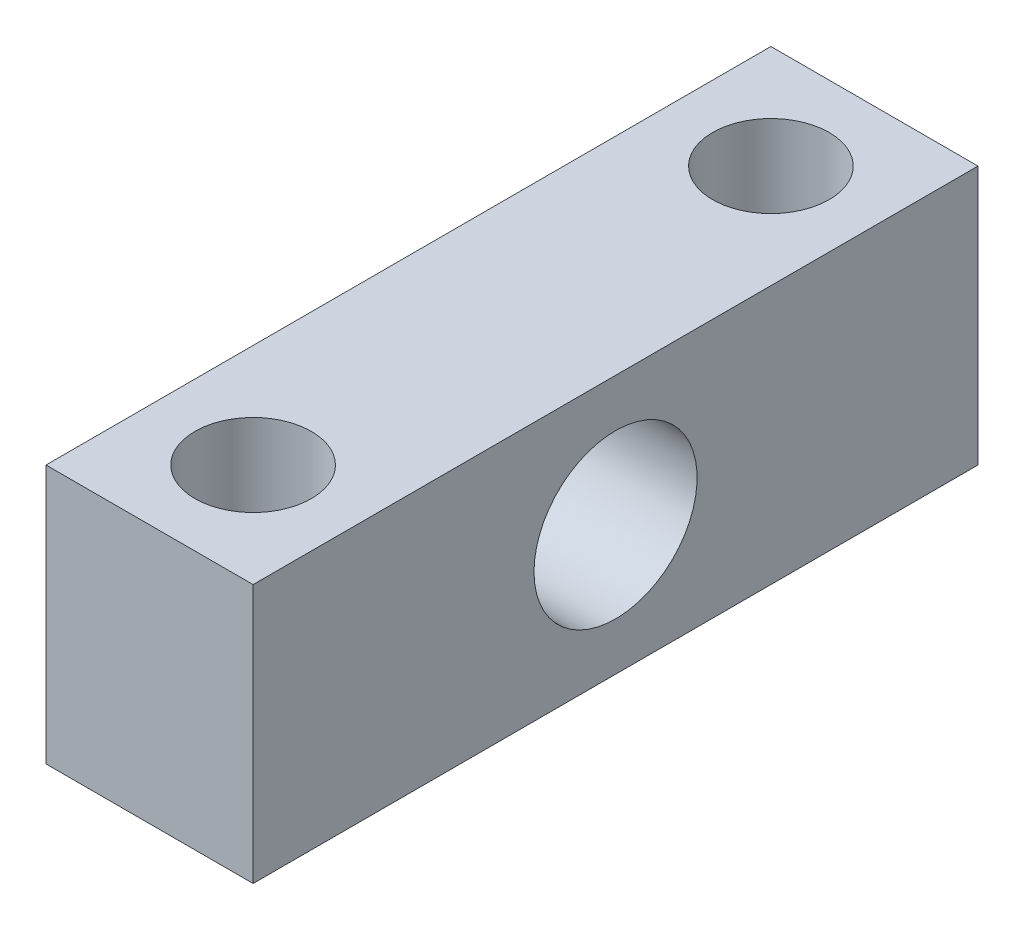
ISO-10303-21;
HEADER;
FILE_DESCRIPTION(('STEP AP214'),'2;1');
FILE_NAME('part.step','',(''),(''),'','','');
FILE_SCHEMA(('AUTOMOTIVE_DESIGN { 1 0 10303 214 1 1 1 1 }'));
ENDSEC;
DATA;
#1=APPLICATION_CONTEXT('core data for automotive mechanical design processes');
#2=APPLICATION_PROTOCOL_DEFINITION('international standard','automotive_design',2000,#1);
#3=PRODUCT_CONTEXT('',#1,'mechanical');
#4=PRODUCT('Part','Part','',(#3));
#5=PRODUCT_RELATED_PRODUCT_CATEGORY('part','',(#4));
#6=PRODUCT_DEFINITION_FORMATION('','',#4);
#7=PRODUCT_DEFINITION_CONTEXT('part definition',#1,'design');
#8=PRODUCT_DEFINITION('design','',#6,#7);
#9=PRODUCT_DEFINITION_SHAPE('','',#8);
#10=(LENGTH_UNIT() NAMED_UNIT(*) SI_UNIT(.MILLI.,.METRE.));
#11=(NAMED_UNIT(*) PLANE_ANGLE_UNIT() SI_UNIT($,.RADIAN.));
#12=(NAMED_UNIT(*) SI_UNIT($,.STERADIAN.) SOLID_ANGLE_UNIT());
#13=UNCERTAINTY_MEASURE_WITH_UNIT(LENGTH_MEASURE(1.E-05),#10,'distance_accuracy_value','');
#14=(GEOMETRIC_REPRESENTATION_CONTEXT(3) GLOBAL_UNCERTAINTY_ASSIGNED_CONTEXT((#13)) GLOBAL_UNIT_ASSIGNED_CONTEXT((#10,
#11,#12)) REPRESENTATION_CONTEXT('',''));
#15=CARTESIAN_POINT('',(0.,0.,0.));
#16=DIRECTION('',(0.,0.,1.));
#17=DIRECTION('',(1.,0.,0.));
#18=AXIS2_PLACEMENT_3D('',#15,#16,#17);
#19=CARTESIAN_POINT('',(8.,5.,14.));
#20=DIRECTION('',(-1.,0.,0.));
#21=DIRECTION('',(0.,0.,1.));
#22=AXIS2_PLACEMENT_3D('',#19,#20,#21);
#23=CYLINDRICAL_SURFACE('',#22,3.15);
#24=CARTESIAN_POINT('',(8.,5.,14.));
#25=DIRECTION('',(-1.,0.,0.));
#26=DIRECTION('',(0.,0.,1.));
#27=AXIS2_PLACEMENT_3D('',#24,#25,#26);
#28=CIRCLE('',#27,3.15);
#29=CARTESIAN_POINT('',(8.,5.,17.15));
#30=VERTEX_POINT('',#29);
#31=EDGE_CURVE('E121',#30,#30,#28,.T.);
#32=ORIENTED_EDGE('',*,*,#31,.F.);
#33=EDGE_LOOP('',(#32));
#34=FACE_BOUND('',#33,.T.);
#35=CARTESIAN_POINT('',(1.,5.,14.));
#36=DIRECTION('',(-1.,0.,0.));
#37=DIRECTION('',(0.,0.,1.));
#38=AXIS2_PLACEMENT_3D('',#35,#36,#37);
#39=CIRCLE('',#38,3.15);
#40=CARTESIAN_POINT('',(1.,5.,17.15));
#41=VERTEX_POINT('',#40);
#42=EDGE_CURVE('E36',#41,#41,#39,.F.);
#43=ORIENTED_EDGE('',*,*,#42,.F.);
#44=EDGE_LOOP('',(#43));
#45=FACE_BOUND('',#44,.T.);
#46=ADVANCED_FACE('F32',(#34,#45),#23,.F.);
#47=CARTESIAN_POINT('',(0.,0.,28.));
#48=DIRECTION('',(1.,0.,0.));
#49=DIRECTION('',(0.,0.,-1.));
#50=AXIS2_PLACEMENT_3D('',#47,#48,#49);
#51=PLANE('',#50);
#52=CARTESIAN_POINT('',(0.,5.,14.));
#53=DIRECTION('',(-1.,0.,0.));
#54=DIRECTION('',(0.,0.,1.));
#55=AXIS2_PLACEMENT_3D('',#52,#53,#54);
#56=CIRCLE('',#55,3.65);
#57=CARTESIAN_POINT('',(0.,5.,17.65));
#58=VERTEX_POINT('',#57);
#59=EDGE_CURVE('E126',#58,#58,#56,.T.);
#60=ORIENTED_EDGE('',*,*,#59,.F.);
#61=EDGE_LOOP('',(#60));
#62=FACE_BOUND('',#61,.T.);
#63=DIRECTION('',(0.,-1.,0.));
#64=VECTOR('',#63,1.);
#65=CARTESIAN_POINT('',(0.,0.,0.));
#66=LINE('',#65,#64);
#67=CARTESIAN_POINT('',(0.,10.,0.));
#68=VERTEX_POINT('',#67);
#69=CARTESIAN_POINT('',(0.,0.,0.));
#70=VERTEX_POINT('',#69);
#71=EDGE_CURVE('E98',#68,#70,#66,.T.);
#72=ORIENTED_EDGE('',*,*,#71,.T.);
#73=DIRECTION('',(0.,0.,-1.));
#74=VECTOR('',#73,1.);
#75=CARTESIAN_POINT('',(0.,0.,28.));
#76=LINE('',#75,#74);
#77=CARTESIAN_POINT('',(0.,0.,28.));
#78=VERTEX_POINT('',#77);
#79=EDGE_CURVE('E11',#78,#70,#76,.T.);
#80=ORIENTED_EDGE('',*,*,#79,.F.);
#81=DIRECTION('',(0.,-1.,0.));
#82=VECTOR('',#81,1.);
#83=CARTESIAN_POINT('',(0.,0.,28.));
#84=LINE('',#83,#82);
#85=CARTESIAN_POINT('',(0.,10.,28.));
#86=VERTEX_POINT('',#85);
#87=EDGE_CURVE('E85',#86,#78,#84,.T.);
#88=ORIENTED_EDGE('',*,*,#87,.F.);
#89=DIRECTION('',(0.,0.,-1.));
#90=VECTOR('',#89,1.);
#91=CARTESIAN_POINT('',(0.,10.,28.));
#92=LINE('',#91,#90);
#93=EDGE_CURVE('E94',#86,#68,#92,.T.);
#94=ORIENTED_EDGE('',*,*,#93,.T.);
#95=EDGE_LOOP('',(#72,#80,#88,#94));
#96=FACE_BOUND('',#95,.T.);
#97=ADVANCED_FACE('F34',(#62,#96),#51,.F.);
#98=CARTESIAN_POINT('',(0.,0.,28.));
#99=DIRECTION('',(0.,1.,0.));
#100=DIRECTION('',(0.,0.,1.));
#101=AXIS2_PLACEMENT_3D('',#98,#99,#100);
#102=PLANE('',#101);
#103=CARTESIAN_POINT('',(4.,0.,4.));
#104=DIRECTION('',(0.,1.,0.));
#105=DIRECTION('',(0.,0.,-1.));
#106=AXIS2_PLACEMENT_3D('',#103,#104,#105);
#107=CIRCLE('',#106,2.25);
#108=CARTESIAN_POINT('',(4.,0.,1.75));
#109=VERTEX_POINT('',#108);
#110=EDGE_CURVE('E115',#109,#109,#107,.T.);
#111=ORIENTED_EDGE('',*,*,#110,.T.);
#112=EDGE_LOOP('',(#111));
#113=FACE_BOUND('',#112,.T.);
#114=CARTESIAN_POINT('',(4.,0.,24.));
#115=DIRECTION('',(0.,1.,0.));
#116=DIRECTION('',(0.,0.,1.));
#117=AXIS2_PLACEMENT_3D('',#114,#115,#116);
#118=CIRCLE('',#117,2.25);
#119=CARTESIAN_POINT('',(4.,0.,26.25));
#120=VERTEX_POINT('',#119);
#121=EDGE_CURVE('E101',#120,#120,#118,.T.);
#122=ORIENTED_EDGE('',*,*,#121,.T.);
#123=EDGE_LOOP('',(#122));
#124=FACE_BOUND('',#123,.T.);
#125=DIRECTION('',(1.,0.,0.));
#126=VECTOR('',#125,1.);
#127=CARTESIAN_POINT('',(0.,0.,0.));
#128=LINE('',#127,#126);
#129=CARTESIAN_POINT('',(8.,0.,0.));
#130=VERTEX_POINT('',#129);
#131=EDGE_CURVE('E89',#70,#130,#128,.T.);
#132=ORIENTED_EDGE('',*,*,#131,.T.);
#133=DIRECTION('',(0.,0.,-1.));
#134=VECTOR('',#133,1.);
#135=CARTESIAN_POINT('',(8.,0.,28.));
#136=LINE('',#135,#134);
#137=CARTESIAN_POINT('',(8.,0.,28.));
#138=VERTEX_POINT('',#137);
#139=EDGE_CURVE('E42',#138,#130,#136,.T.);
#140=ORIENTED_EDGE('',*,*,#139,.F.);
#141=DIRECTION('',(1.,0.,0.));
#142=VECTOR('',#141,1.);
#143=CARTESIAN_POINT('',(0.,0.,28.));
#144=LINE('',#143,#142);
#145=EDGE_CURVE('E80',#78,#138,#144,.T.);
#146=ORIENTED_EDGE('',*,*,#145,.F.);
#147=ORIENTED_EDGE('',*,*,#79,.T.);
#148=EDGE_LOOP('',(#132,#140,#146,#147));
#149=FACE_BOUND('',#148,.T.);
#150=ADVANCED_FACE('F88',(#113,#124,#149),#102,.F.);
#151=CARTESIAN_POINT('',(8.,0.,28.));
#152=DIRECTION('',(-1.,0.,0.));
#153=DIRECTION('',(0.,0.,1.));
#154=AXIS2_PLACEMENT_3D('',#151,#152,#153);
#155=PLANE('',#154);
#156=ORIENTED_EDGE('',*,*,#31,.T.);
#157=EDGE_LOOP('',(#156));
#158=FACE_BOUND('',#157,.T.);
#159=DIRECTION('',(0.,1.,0.));
#160=VECTOR('',#159,1.);
#161=CARTESIAN_POINT('',(8.,0.,0.));
#162=LINE('',#161,#160);
#163=CARTESIAN_POINT('',(8.,10.,0.));
#164=VERTEX_POINT('',#163);
#165=EDGE_CURVE('E67',#130,#164,#162,.T.);
#166=ORIENTED_EDGE('',*,*,#165,.T.);
#167=DIRECTION('',(0.,0.,-1.));
#168=VECTOR('',#167,1.);
#169=CARTESIAN_POINT('',(8.,10.,28.));
#170=LINE('',#169,#168);
#171=CARTESIAN_POINT('',(8.,10.,28.));
#172=VERTEX_POINT('',#171);
#173=EDGE_CURVE('E90',#172,#164,#170,.T.);
#174=ORIENTED_EDGE('',*,*,#173,.F.);
#175=DIRECTION('',(0.,1.,0.));
#176=VECTOR('',#175,1.);
#177=CARTESIAN_POINT('',(8.,0.,28.));
#178=LINE('',#177,#176);
#179=EDGE_CURVE('E83',#138,#172,#178,.T.);
#180=ORIENTED_EDGE('',*,*,#179,.F.);
#181=ORIENTED_EDGE('',*,*,#139,.T.);
#182=EDGE_LOOP('',(#166,#174,#180,#181));
#183=FACE_BOUND('',#182,.T.);
#184=ADVANCED_FACE('F92',(#158,#183),#155,.F.);
#185=CARTESIAN_POINT('',(0.,10.,28.));
#186=DIRECTION('',(0.,-1.,0.));
#187=DIRECTION('',(1.,0.,0.));
#188=AXIS2_PLACEMENT_3D('',#185,#186,#187);
#189=PLANE('',#188);
#190=CARTESIAN_POINT('',(4.,10.,4.));
#191=DIRECTION('',(0.,1.,0.));
#192=DIRECTION('',(0.,0.,-1.));
#193=AXIS2_PLACEMENT_3D('',#190,#191,#192);
#194=CIRCLE('',#193,2.25);
#195=CARTESIAN_POINT('',(4.,10.,1.75));
#196=VERTEX_POINT('',#195);
#197=EDGE_CURVE('E118',#196,#196,#194,.T.);
#198=ORIENTED_EDGE('',*,*,#197,.F.);
#199=EDGE_LOOP('',(#198));
#200=FACE_BOUND('',#199,.T.);
#201=CARTESIAN_POINT('',(4.,10.,24.));
#202=DIRECTION('',(0.,1.,0.));
#203=DIRECTION('',(0.,0.,1.));
#204=AXIS2_PLACEMENT_3D('',#201,#202,#203);
#205=CIRCLE('',#204,2.25);
#206=CARTESIAN_POINT('',(4.,10.,26.25));
#207=VERTEX_POINT('',#206);
#208=EDGE_CURVE('E112',#207,#207,#205,.T.);
#209=ORIENTED_EDGE('',*,*,#208,.F.);
#210=EDGE_LOOP('',(#209));
#211=FACE_BOUND('',#210,.T.);
#212=DIRECTION('',(-1.,0.,0.));
#213=VECTOR('',#212,1.);
#214=CARTESIAN_POINT('',(0.,10.,0.));
#215=LINE('',#214,#213);
#216=EDGE_CURVE('E73',#164,#68,#215,.T.);
#217=ORIENTED_EDGE('',*,*,#216,.T.);
#218=ORIENTED_EDGE('',*,*,#93,.F.);
#219=DIRECTION('',(-1.,0.,0.));
#220=VECTOR('',#219,1.);
#221=CARTESIAN_POINT('',(0.,10.,28.));
#222=LINE('',#221,#220);
#223=EDGE_CURVE('E50',#172,#86,#222,.T.);
#224=ORIENTED_EDGE('',*,*,#223,.F.);
#225=ORIENTED_EDGE('',*,*,#173,.T.);
#226=EDGE_LOOP('',(#217,#218,#224,#225));
#227=FACE_BOUND('',#226,.T.);
#228=ADVANCED_FACE('F106',(#200,#211,#227),#189,.F.);
#229=CARTESIAN_POINT('',(0.,0.,28.));
#230=DIRECTION('',(0.,0.,-1.));
#231=DIRECTION('',(-1.,0.,0.));
#232=AXIS2_PLACEMENT_3D('',#229,#230,#231);
#233=PLANE('',#232);
#234=ORIENTED_EDGE('',*,*,#87,.T.);
#235=ORIENTED_EDGE('',*,*,#145,.T.);
#236=ORIENTED_EDGE('',*,*,#179,.T.);
#237=ORIENTED_EDGE('',*,*,#223,.T.);
#238=EDGE_LOOP('',(#234,#235,#236,#237));
#239=FACE_BOUND('',#238,.T.);
#240=ADVANCED_FACE('F81',(#239),#233,.F.);
#241=CARTESIAN_POINT('',(0.,0.,0.));
#242=DIRECTION('',(0.,0.,-1.));
#243=DIRECTION('',(-1.,0.,0.));
#244=AXIS2_PLACEMENT_3D('',#241,#242,#243);
#245=PLANE('',#244);
#246=ORIENTED_EDGE('',*,*,#71,.F.);
#247=ORIENTED_EDGE('',*,*,#216,.F.);
#248=ORIENTED_EDGE('',*,*,#165,.F.);
#249=ORIENTED_EDGE('',*,*,#131,.F.);
#250=EDGE_LOOP('',(#246,#247,#248,#249));
#251=FACE_BOUND('',#250,.T.);
#252=ADVANCED_FACE('F109',(#251),#245,.T.);
#253=CARTESIAN_POINT('',(4.,0.,24.));
#254=DIRECTION('',(0.,1.,0.));
#255=DIRECTION('',(0.,0.,1.));
#256=AXIS2_PLACEMENT_3D('',#253,#254,#255);
#257=CYLINDRICAL_SURFACE('',#256,2.25);
#258=ORIENTED_EDGE('',*,*,#121,.F.);
#259=EDGE_LOOP('',(#258));
#260=FACE_BOUND('',#259,.T.);
#261=ORIENTED_EDGE('',*,*,#208,.T.);
#262=EDGE_LOOP('',(#261));
#263=FACE_BOUND('',#262,.T.);
#264=ADVANCED_FACE('F153',(#260,#263),#257,.F.);
#265=CARTESIAN_POINT('',(4.,0.,4.));
#266=DIRECTION('',(0.,1.,0.));
#267=DIRECTION('',(0.,0.,1.));
#268=AXIS2_PLACEMENT_3D('',#265,#266,#267);
#269=CYLINDRICAL_SURFACE('',#268,2.25);
#270=ORIENTED_EDGE('',*,*,#110,.F.);
#271=EDGE_LOOP('',(#270));
#272=FACE_BOUND('',#271,.T.);
#273=ORIENTED_EDGE('',*,*,#197,.T.);
#274=EDGE_LOOP('',(#273));
#275=FACE_BOUND('',#274,.T.);
#276=ADVANCED_FACE('F150',(#272,#275),#269,.F.);
#277=CARTESIAN_POINT('',(1.,5.,14.));
#278=DIRECTION('',(-1.,0.,0.));
#279=DIRECTION('',(0.,0.,1.));
#280=AXIS2_PLACEMENT_3D('',#277,#278,#279);
#281=PLANE('',#280);
#282=CARTESIAN_POINT('',(1.,5.,14.));
#283=DIRECTION('',(-1.,0.,0.));
#284=DIRECTION('',(0.,0.,1.));
#285=AXIS2_PLACEMENT_3D('',#282,#283,#284);
#286=CIRCLE('',#285,3.65);
#287=CARTESIAN_POINT('',(1.,5.,17.65));
#288=VERTEX_POINT('',#287);
#289=EDGE_CURVE('E129',#288,#288,#286,.T.);
#290=ORIENTED_EDGE('',*,*,#289,.T.);
#291=EDGE_LOOP('',(#290));
#292=FACE_BOUND('',#291,.T.);
#293=ORIENTED_EDGE('',*,*,#42,.T.);
#294=EDGE_LOOP('',(#293));
#295=FACE_BOUND('',#294,.T.);
#296=ADVANCED_FACE('F136',(#292,#295),#281,.T.);
#297=CARTESIAN_POINT('',(1.,5.,14.));
#298=DIRECTION('',(-1.,0.,0.));
#299=DIRECTION('',(0.,0.,1.));
#300=AXIS2_PLACEMENT_3D('',#297,#298,#299);
#301=CYLINDRICAL_SURFACE('',#300,3.65);
#302=ORIENTED_EDGE('',*,*,#289,.F.);
#303=EDGE_LOOP('',(#302));
#304=FACE_BOUND('',#303,.T.);
#305=ORIENTED_EDGE('',*,*,#59,.T.);
#306=EDGE_LOOP('',(#305));
#307=FACE_BOUND('',#306,.T.);
#308=ADVANCED_FACE('F148',(#304,#307),#301,.F.);
#309=CLOSED_SHELL('',(#46,#97,#150,#184,#228,#240,#252,#264,#276,#296,#308));
#310=MANIFOLD_SOLID_BREP('B2',#309);
#311=ADVANCED_BREP_SHAPE_REPRESENTATION('',(#18,#310),#14);
#312=SHAPE_DEFINITION_REPRESENTATION(#9,#311);
ENDSEC;
END-ISO-10303-21;
